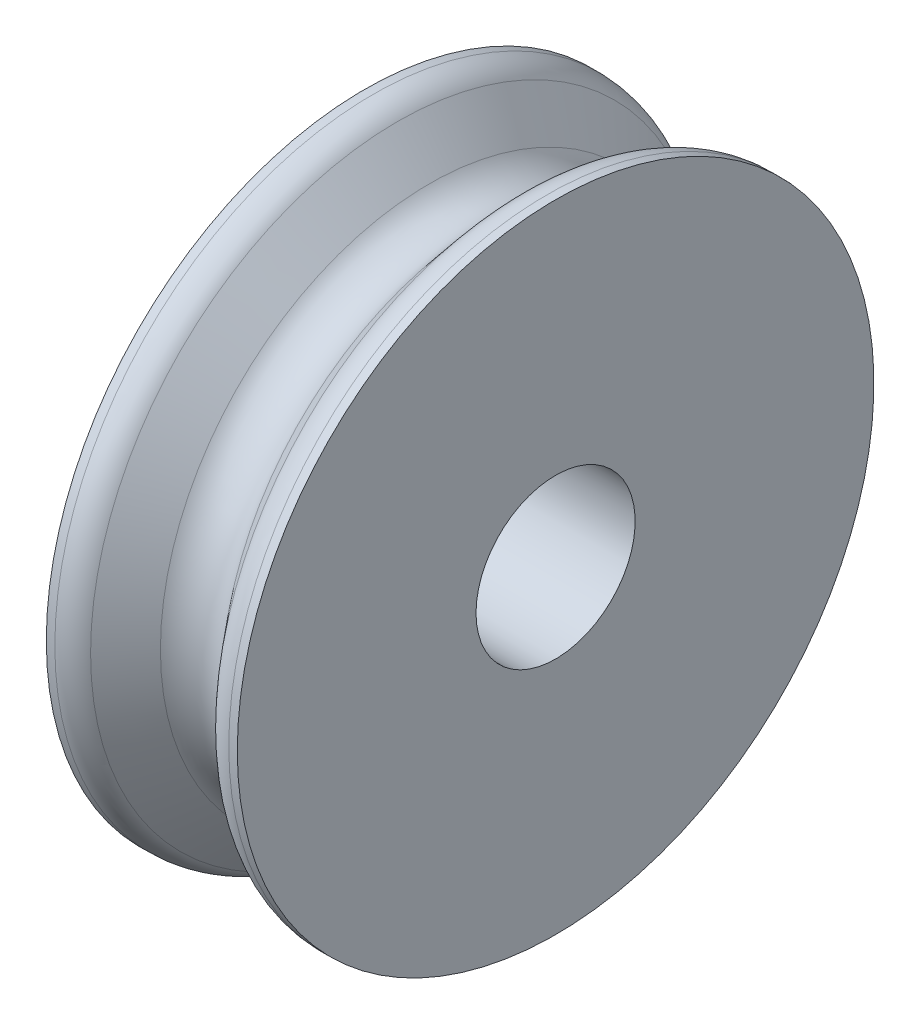
ISO-10303-21;
HEADER;
FILE_DESCRIPTION(('STEP AP214'),'2;1');
FILE_NAME('part.step','',(''),(''),'','','');
FILE_SCHEMA(('AUTOMOTIVE_DESIGN { 1 0 10303 214 1 1 1 1 }'));
ENDSEC;
DATA;
#1=APPLICATION_CONTEXT('core data for automotive mechanical design processes');
#2=APPLICATION_PROTOCOL_DEFINITION('international standard','automotive_design',2000,#1);
#3=PRODUCT_CONTEXT('',#1,'mechanical');
#4=PRODUCT('Part','Part','',(#3));
#5=PRODUCT_RELATED_PRODUCT_CATEGORY('part','',(#4));
#6=PRODUCT_DEFINITION_FORMATION('','',#4);
#7=PRODUCT_DEFINITION_CONTEXT('part definition',#1,'design');
#8=PRODUCT_DEFINITION('design','',#6,#7);
#9=PRODUCT_DEFINITION_SHAPE('','',#8);
#10=(LENGTH_UNIT() NAMED_UNIT(*) SI_UNIT(.MILLI.,.METRE.));
#11=(NAMED_UNIT(*) PLANE_ANGLE_UNIT() SI_UNIT($,.RADIAN.));
#12=(NAMED_UNIT(*) SI_UNIT($,.STERADIAN.) SOLID_ANGLE_UNIT());
#13=UNCERTAINTY_MEASURE_WITH_UNIT(LENGTH_MEASURE(1.E-05),#10,'distance_accuracy_value','');
#14=(GEOMETRIC_REPRESENTATION_CONTEXT(3) GLOBAL_UNCERTAINTY_ASSIGNED_CONTEXT((#13)) GLOBAL_UNIT_ASSIGNED_CONTEXT((#10,
#11,#12)) REPRESENTATION_CONTEXT('',''));
#15=CARTESIAN_POINT('',(0.,0.,0.));
#16=DIRECTION('',(0.,0.,1.));
#17=DIRECTION('',(1.,0.,0.));
#18=AXIS2_PLACEMENT_3D('',#15,#16,#17);
#19=CARTESIAN_POINT('',(0.,0.,0.));
#20=DIRECTION('',(-1.,0.,0.));
#21=DIRECTION('',(0.,0.,1.));
#22=AXIS2_PLACEMENT_3D('',#19,#20,#21);
#23=TOROIDAL_SURFACE('',#22,46.3,6.3);
#24=CARTESIAN_POINT('',(-4.82607999164955,0.,0.));
#25=DIRECTION('',(-1.,0.,0.));
#26=DIRECTION('',(0.,0.,1.));
#27=AXIS2_PLACEMENT_3D('',#24,#25,#26);
#28=CIRCLE('',#27,42.2504380589748);
#29=CARTESIAN_POINT('',(-4.82607999164955,0.,42.2504380589748));
#30=VERTEX_POINT('',#29);
#31=EDGE_CURVE('E50',#30,#30,#28,.T.);
#32=ORIENTED_EDGE('',*,*,#31,.F.);
#33=EDGE_LOOP('',(#32));
#34=FACE_BOUND('',#33,.T.);
#35=CARTESIAN_POINT('',(4.82607999164955,0.,0.));
#36=DIRECTION('',(-1.,0.,0.));
#37=DIRECTION('',(0.,0.,1.));
#38=AXIS2_PLACEMENT_3D('',#35,#36,#37);
#39=CIRCLE('',#38,42.2504380589748);
#40=CARTESIAN_POINT('',(4.82607999164955,0.,42.2504380589748));
#41=VERTEX_POINT('',#40);
#42=EDGE_CURVE('E59',#41,#41,#39,.T.);
#43=ORIENTED_EDGE('',*,*,#42,.T.);
#44=EDGE_LOOP('',(#43));
#45=FACE_BOUND('',#44,.T.);
#46=ADVANCED_FACE('F30',(#34,#45),#23,.F.);
#47=CARTESIAN_POINT('',(-4.82607999164955,0.,0.));
#48=DIRECTION('',(-1.,0.,0.));
#49=DIRECTION('',(0.,0.,1.));
#50=AXIS2_PLACEMENT_3D('',#47,#48,#49);
#51=CONICAL_SURFACE('',#50,42.2504380589748,0.872664625997163);
#52=CARTESIAN_POINT('',(-9.83005063332944,0.,0.));
#53=DIRECTION('',(1.,0.,0.));
#54=DIRECTION('',(0.,0.,-1.));
#55=AXIS2_PLACEMENT_3D('',#52,#53,#54);
#56=CIRCLE('',#55,48.2139380484327);
#57=CARTESIAN_POINT('',(-9.83005063332944,0.,-48.2139380484327));
#58=VERTEX_POINT('',#57);
#59=EDGE_CURVE('E10',#58,#58,#56,.T.);
#60=ORIENTED_EDGE('',*,*,#59,.T.);
#61=EDGE_LOOP('',(#60));
#62=FACE_BOUND('',#61,.T.);
#63=ORIENTED_EDGE('',*,*,#31,.T.);
#64=EDGE_LOOP('',(#63));
#65=FACE_BOUND('',#64,.T.);
#66=ADVANCED_FACE('F89',(#62,#65),#51,.T.);
#67=CARTESIAN_POINT('',(-75.888260409414,0.,0.));
#68=DIRECTION('',(-1.,0.,0.));
#69=DIRECTION('',(0.,0.,1.));
#70=AXIS2_PLACEMENT_3D('',#67,#68,#69);
#71=CYLINDRICAL_SURFACE('',#70,50.);
#72=CARTESIAN_POINT('',(-13.6602728489243,0.,0.));
#73=DIRECTION('',(1.,0.,0.));
#74=DIRECTION('',(0.,0.,-1.));
#75=AXIS2_PLACEMENT_3D('',#72,#73,#74);
#76=CIRCLE('',#75,50.);
#77=CARTESIAN_POINT('',(-13.6602728489243,0.,-50.));
#78=VERTEX_POINT('',#77);
#79=EDGE_CURVE('E37',#78,#78,#76,.F.);
#80=ORIENTED_EDGE('',*,*,#79,.T.);
#81=EDGE_LOOP('',(#80));
#82=FACE_BOUND('',#81,.T.);
#83=CARTESIAN_POINT('',(-15.,0.,0.));
#84=DIRECTION('',(-1.,0.,0.));
#85=DIRECTION('',(0.,0.,1.));
#86=AXIS2_PLACEMENT_3D('',#83,#84,#85);
#87=CIRCLE('',#86,50.);
#88=CARTESIAN_POINT('',(-15.,0.,50.));
#89=VERTEX_POINT('',#88);
#90=EDGE_CURVE('E53',#89,#89,#87,.T.);
#91=ORIENTED_EDGE('',*,*,#90,.F.);
#92=EDGE_LOOP('',(#91));
#93=FACE_BOUND('',#92,.T.);
#94=ADVANCED_FACE('F85',(#82,#93),#71,.T.);
#95=CARTESIAN_POINT('',(-15.,50.,0.));
#96=DIRECTION('',(1.,0.,0.));
#97=DIRECTION('',(0.,0.,-1.));
#98=AXIS2_PLACEMENT_3D('',#95,#96,#97);
#99=PLANE('',#98);
#100=CARTESIAN_POINT('',(-15.,0.,0.));
#101=DIRECTION('',(-1.,0.,0.));
#102=DIRECTION('',(0.,0.,1.));
#103=AXIS2_PLACEMENT_3D('',#100,#101,#102);
#104=CIRCLE('',#103,12.5);
#105=CARTESIAN_POINT('',(-15.,0.,12.5));
#106=VERTEX_POINT('',#105);
#107=EDGE_CURVE('E56',#106,#106,#104,.T.);
#108=ORIENTED_EDGE('',*,*,#107,.F.);
#109=EDGE_LOOP('',(#108));
#110=FACE_BOUND('',#109,.T.);
#111=ORIENTED_EDGE('',*,*,#90,.T.);
#112=EDGE_LOOP('',(#111));
#113=FACE_BOUND('',#112,.T.);
#114=ADVANCED_FACE('F75',(#110,#113),#99,.F.);
#115=CARTESIAN_POINT('',(-75.888260409414,0.,0.));
#116=DIRECTION('',(-1.,0.,0.));
#117=DIRECTION('',(0.,0.,1.));
#118=AXIS2_PLACEMENT_3D('',#115,#116,#117);
#119=CYLINDRICAL_SURFACE('',#118,12.5);
#120=ORIENTED_EDGE('',*,*,#107,.T.);
#121=EDGE_LOOP('',(#120));
#122=FACE_BOUND('',#121,.T.);
#123=CARTESIAN_POINT('',(15.,0.,0.));
#124=DIRECTION('',(-1.,0.,0.));
#125=DIRECTION('',(0.,0.,1.));
#126=AXIS2_PLACEMENT_3D('',#123,#124,#125);
#127=CIRCLE('',#126,12.5);
#128=CARTESIAN_POINT('',(15.,0.,12.5));
#129=VERTEX_POINT('',#128);
#130=EDGE_CURVE('E65',#129,#129,#127,.T.);
#131=ORIENTED_EDGE('',*,*,#130,.F.);
#132=EDGE_LOOP('',(#131));
#133=FACE_BOUND('',#132,.T.);
#134=ADVANCED_FACE('F72',(#122,#133),#119,.F.);
#135=CARTESIAN_POINT('',(4.82607999164955,0.,0.));
#136=DIRECTION('',(1.,0.,0.));
#137=DIRECTION('',(0.,0.,1.));
#138=AXIS2_PLACEMENT_3D('',#135,#136,#137);
#139=CONICAL_SURFACE('',#138,42.2504380589748,0.872664625997163);
#140=CARTESIAN_POINT('',(9.83005063332944,0.,0.));
#141=DIRECTION('',(-1.,0.,0.));
#142=DIRECTION('',(0.,0.,1.));
#143=AXIS2_PLACEMENT_3D('',#140,#141,#142);
#144=CIRCLE('',#143,48.2139380484327);
#145=CARTESIAN_POINT('',(9.83005063332944,0.,48.2139380484327));
#146=VERTEX_POINT('',#145);
#147=EDGE_CURVE('E45',#146,#146,#144,.T.);
#148=ORIENTED_EDGE('',*,*,#147,.T.);
#149=EDGE_LOOP('',(#148));
#150=FACE_BOUND('',#149,.T.);
#151=ORIENTED_EDGE('',*,*,#42,.F.);
#152=EDGE_LOOP('',(#151));
#153=FACE_BOUND('',#152,.T.);
#154=ADVANCED_FACE('F74',(#150,#153),#139,.T.);
#155=CARTESIAN_POINT('',(75.888260409414,0.,0.));
#156=DIRECTION('',(1.,0.,0.));
#157=DIRECTION('',(0.,0.,1.));
#158=AXIS2_PLACEMENT_3D('',#155,#156,#157);
#159=CYLINDRICAL_SURFACE('',#158,50.);
#160=CARTESIAN_POINT('',(13.6602728489243,0.,0.));
#161=DIRECTION('',(1.,0.,0.));
#162=DIRECTION('',(0.,0.,-1.));
#163=AXIS2_PLACEMENT_3D('',#160,#161,#162);
#164=CIRCLE('',#163,50.);
#165=CARTESIAN_POINT('',(13.6602728489243,0.,-50.));
#166=VERTEX_POINT('',#165);
#167=EDGE_CURVE('E41',#166,#166,#164,.T.);
#168=ORIENTED_EDGE('',*,*,#167,.T.);
#169=EDGE_LOOP('',(#168));
#170=FACE_BOUND('',#169,.T.);
#171=CARTESIAN_POINT('',(15.,0.,0.));
#172=DIRECTION('',(-1.,0.,0.));
#173=DIRECTION('',(0.,0.,1.));
#174=AXIS2_PLACEMENT_3D('',#171,#172,#173);
#175=CIRCLE('',#174,50.);
#176=CARTESIAN_POINT('',(15.,0.,50.));
#177=VERTEX_POINT('',#176);
#178=EDGE_CURVE('E62',#177,#177,#175,.T.);
#179=ORIENTED_EDGE('',*,*,#178,.T.);
#180=EDGE_LOOP('',(#179));
#181=FACE_BOUND('',#180,.T.);
#182=ADVANCED_FACE('F82',(#170,#181),#159,.T.);
#183=CARTESIAN_POINT('',(15.,50.,0.));
#184=DIRECTION('',(-1.,0.,0.));
#185=DIRECTION('',(0.,0.,-1.));
#186=AXIS2_PLACEMENT_3D('',#183,#184,#185);
#187=PLANE('',#186);
#188=ORIENTED_EDGE('',*,*,#130,.T.);
#189=EDGE_LOOP('',(#188));
#190=FACE_BOUND('',#189,.T.);
#191=ORIENTED_EDGE('',*,*,#178,.F.);
#192=EDGE_LOOP('',(#191));
#193=FACE_BOUND('',#192,.T.);
#194=ADVANCED_FACE('F69',(#190,#193),#187,.F.);
#195=CARTESIAN_POINT('',(13.6602728489243,0.,0.));
#196=DIRECTION('',(1.,0.,0.));
#197=DIRECTION('',(0.,0.,-1.));
#198=AXIS2_PLACEMENT_3D('',#195,#196,#197);
#199=TOROIDAL_SURFACE('',#198,45.,5.);
#200=ORIENTED_EDGE('',*,*,#167,.F.);
#201=EDGE_LOOP('',(#200));
#202=FACE_BOUND('',#201,.T.);
#203=ORIENTED_EDGE('',*,*,#147,.F.);
#204=EDGE_LOOP('',(#203));
#205=FACE_BOUND('',#204,.T.);
#206=ADVANCED_FACE('F99',(#202,#205),#199,.T.);
#207=CARTESIAN_POINT('',(-13.6602728489243,0.,0.));
#208=DIRECTION('',(1.,0.,0.));
#209=DIRECTION('',(0.,0.,-1.));
#210=AXIS2_PLACEMENT_3D('',#207,#208,#209);
#211=TOROIDAL_SURFACE('',#210,45.,5.);
#212=ORIENTED_EDGE('',*,*,#59,.F.);
#213=EDGE_LOOP('',(#212));
#214=FACE_BOUND('',#213,.T.);
#215=ORIENTED_EDGE('',*,*,#79,.F.);
#216=EDGE_LOOP('',(#215));
#217=FACE_BOUND('',#216,.T.);
#218=ADVANCED_FACE('F32',(#214,#217),#211,.T.);
#219=CLOSED_SHELL('',(#46,#66,#94,#114,#134,#154,#182,#194,#206,#218));
#220=MANIFOLD_SOLID_BREP('B2',#219);
#221=ADVANCED_BREP_SHAPE_REPRESENTATION('',(#18,#220),#14);
#222=SHAPE_DEFINITION_REPRESENTATION(#9,#221);
ENDSEC;
END-ISO-10303-21;
